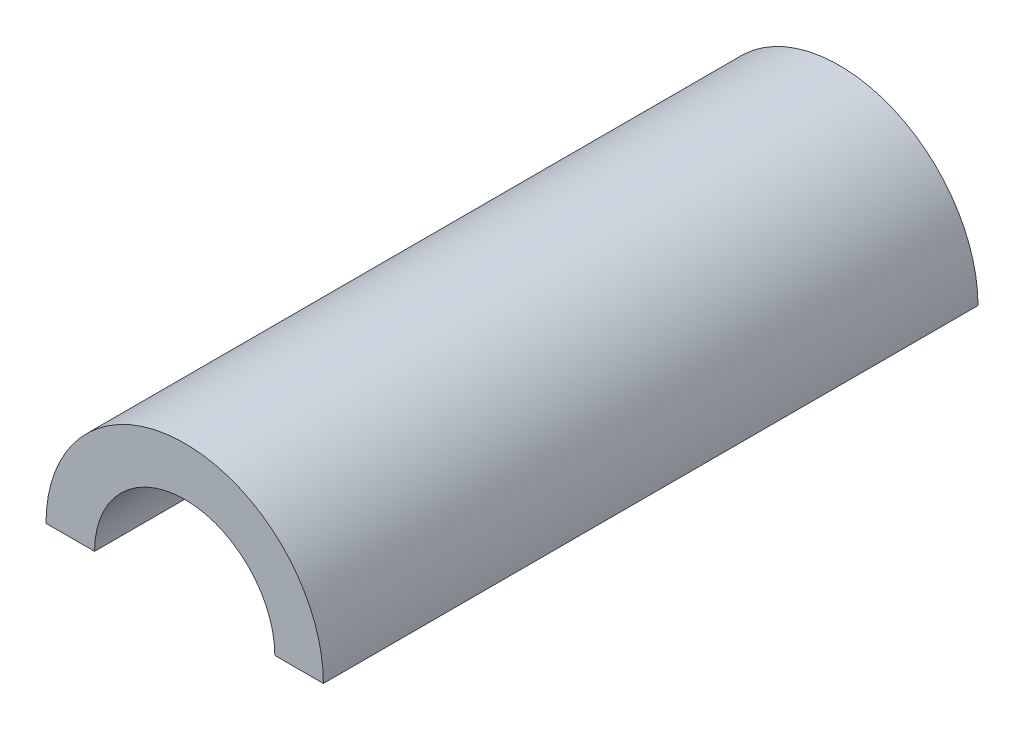
ISO-10303-21;
HEADER;
FILE_DESCRIPTION(('STEP AP214'),'2;1');
FILE_NAME('part.step','',(''),(''),'','','');
FILE_SCHEMA(('AUTOMOTIVE_DESIGN { 1 0 10303 214 1 1 1 1 }'));
ENDSEC;
DATA;
#1=APPLICATION_CONTEXT('core data for automotive mechanical design processes');
#2=APPLICATION_PROTOCOL_DEFINITION('international standard','automotive_design',2000,#1);
#3=PRODUCT_CONTEXT('',#1,'mechanical');
#4=PRODUCT('Part','Part','',(#3));
#5=PRODUCT_RELATED_PRODUCT_CATEGORY('part','',(#4));
#6=PRODUCT_DEFINITION_FORMATION('','',#4);
#7=PRODUCT_DEFINITION_CONTEXT('part definition',#1,'design');
#8=PRODUCT_DEFINITION('design','',#6,#7);
#9=PRODUCT_DEFINITION_SHAPE('','',#8);
#10=(LENGTH_UNIT() NAMED_UNIT(*) SI_UNIT(.MILLI.,.METRE.));
#11=(NAMED_UNIT(*) PLANE_ANGLE_UNIT() SI_UNIT($,.RADIAN.));
#12=(NAMED_UNIT(*) SI_UNIT($,.STERADIAN.) SOLID_ANGLE_UNIT());
#13=UNCERTAINTY_MEASURE_WITH_UNIT(LENGTH_MEASURE(1.E-05),#10,'distance_accuracy_value','');
#14=(GEOMETRIC_REPRESENTATION_CONTEXT(3) GLOBAL_UNCERTAINTY_ASSIGNED_CONTEXT((#13)) GLOBAL_UNIT_ASSIGNED_CONTEXT((#10,
#11,#12)) REPRESENTATION_CONTEXT('',''));
#15=CARTESIAN_POINT('',(0.,0.,0.));
#16=DIRECTION('',(0.,0.,1.));
#17=DIRECTION('',(1.,0.,0.));
#18=AXIS2_PLACEMENT_3D('',#15,#16,#17);
#19=CARTESIAN_POINT('',(0.,0.,47.2));
#20=DIRECTION('',(0.,-1.,0.));
#21=DIRECTION('',(0.,0.,-1.));
#22=AXIS2_PLACEMENT_3D('',#19,#20,#21);
#23=PLANE('',#22);
#24=DIRECTION('',(-1.,0.,0.));
#25=VECTOR('',#24,1.);
#26=CARTESIAN_POINT('',(0.,0.,0.));
#27=LINE('',#26,#25);
#28=CARTESIAN_POINT('',(10.,0.,0.));
#29=VERTEX_POINT('',#28);
#30=CARTESIAN_POINT('',(6.5,0.,0.));
#31=VERTEX_POINT('',#30);
#32=EDGE_CURVE('E120',#29,#31,#27,.T.);
#33=ORIENTED_EDGE('',*,*,#32,.F.);
#34=DIRECTION('',(0.,0.,-1.));
#35=VECTOR('',#34,1.);
#36=CARTESIAN_POINT('',(10.,0.,47.2));
#37=LINE('',#36,#35);
#38=CARTESIAN_POINT('',(10.,0.,47.2));
#39=VERTEX_POINT('',#38);
#40=EDGE_CURVE('E11',#39,#29,#37,.T.);
#41=ORIENTED_EDGE('',*,*,#40,.F.);
#42=DIRECTION('',(-1.,0.,0.));
#43=VECTOR('',#42,1.);
#44=CARTESIAN_POINT('',(0.,0.,47.2));
#45=LINE('',#44,#43);
#46=CARTESIAN_POINT('',(6.5,0.,47.2));
#47=VERTEX_POINT('',#46);
#48=EDGE_CURVE('E95',#39,#47,#45,.T.);
#49=ORIENTED_EDGE('',*,*,#48,.T.);
#50=DIRECTION('',(0.,0.,-1.));
#51=VECTOR('',#50,1.);
#52=CARTESIAN_POINT('',(6.5,0.,47.2));
#53=LINE('',#52,#51);
#54=EDGE_CURVE('E63',#47,#31,#53,.T.);
#55=ORIENTED_EDGE('',*,*,#54,.T.);
#56=EDGE_LOOP('',(#33,#41,#49,#55));
#57=FACE_BOUND('',#56,.T.);
#58=ADVANCED_FACE('F45',(#57),#23,.T.);
#59=CARTESIAN_POINT('',(0.,0.,47.2));
#60=DIRECTION('',(0.,0.,-1.));
#61=DIRECTION('',(-1.,0.,0.));
#62=AXIS2_PLACEMENT_3D('',#59,#60,#61);
#63=CYLINDRICAL_SURFACE('',#62,10.);
#64=CARTESIAN_POINT('',(0.,0.,0.));
#65=DIRECTION('',(0.,0.,1.));
#66=DIRECTION('',(1.,0.,0.));
#67=AXIS2_PLACEMENT_3D('',#64,#65,#66);
#68=CIRCLE('',#67,10.);
#69=CARTESIAN_POINT('',(-10.,0.,0.));
#70=VERTEX_POINT('',#69);
#71=EDGE_CURVE('E101',#29,#70,#68,.T.);
#72=ORIENTED_EDGE('',*,*,#71,.T.);
#73=DIRECTION('',(0.,0.,-1.));
#74=VECTOR('',#73,1.);
#75=CARTESIAN_POINT('',(-10.,0.,47.2));
#76=LINE('',#75,#74);
#77=CARTESIAN_POINT('',(-10.,0.,47.2));
#78=VERTEX_POINT('',#77);
#79=EDGE_CURVE('E55',#78,#70,#76,.T.);
#80=ORIENTED_EDGE('',*,*,#79,.F.);
#81=CARTESIAN_POINT('',(0.,0.,47.2));
#82=DIRECTION('',(0.,0.,1.));
#83=DIRECTION('',(1.,0.,0.));
#84=AXIS2_PLACEMENT_3D('',#81,#82,#83);
#85=CIRCLE('',#84,10.);
#86=EDGE_CURVE('E89',#39,#78,#85,.T.);
#87=ORIENTED_EDGE('',*,*,#86,.F.);
#88=ORIENTED_EDGE('',*,*,#40,.T.);
#89=EDGE_LOOP('',(#72,#80,#87,#88));
#90=FACE_BOUND('',#89,.T.);
#91=ADVANCED_FACE('F47',(#90),#63,.T.);
#92=CARTESIAN_POINT('',(-6.5,0.,0.));
#93=VERTEX_POINT('',#92);
#94=EDGE_CURVE('E115',#93,#70,#27,.T.);
#95=ORIENTED_EDGE('',*,*,#94,.F.);
#96=DIRECTION('',(0.,0.,-1.));
#97=VECTOR('',#96,1.);
#98=CARTESIAN_POINT('',(-6.5,0.,47.2));
#99=LINE('',#98,#97);
#100=CARTESIAN_POINT('',(-6.5,0.,47.2));
#101=VERTEX_POINT('',#100);
#102=EDGE_CURVE('E76',#101,#93,#99,.T.);
#103=ORIENTED_EDGE('',*,*,#102,.F.);
#104=EDGE_CURVE('E94',#101,#78,#45,.T.);
#105=ORIENTED_EDGE('',*,*,#104,.T.);
#106=ORIENTED_EDGE('',*,*,#79,.T.);
#107=EDGE_LOOP('',(#95,#103,#105,#106));
#108=FACE_BOUND('',#107,.T.);
#109=ADVANCED_FACE('F105',(#108),#23,.T.);
#110=CARTESIAN_POINT('',(0.,0.,47.2));
#111=DIRECTION('',(0.,0.,-1.));
#112=DIRECTION('',(-1.,0.,0.));
#113=AXIS2_PLACEMENT_3D('',#110,#111,#112);
#114=CYLINDRICAL_SURFACE('',#113,6.5);
#115=CARTESIAN_POINT('',(0.,0.,0.));
#116=DIRECTION('',(0.,0.,1.));
#117=DIRECTION('',(1.,0.,0.));
#118=AXIS2_PLACEMENT_3D('',#115,#116,#117);
#119=CIRCLE('',#118,6.5);
#120=EDGE_CURVE('E112',#31,#93,#119,.T.);
#121=ORIENTED_EDGE('',*,*,#120,.F.);
#122=ORIENTED_EDGE('',*,*,#54,.F.);
#123=CARTESIAN_POINT('',(0.,0.,47.2));
#124=DIRECTION('',(0.,0.,1.));
#125=DIRECTION('',(1.,0.,0.));
#126=AXIS2_PLACEMENT_3D('',#123,#124,#125);
#127=CIRCLE('',#126,6.5);
#128=EDGE_CURVE('E107',#47,#101,#127,.T.);
#129=ORIENTED_EDGE('',*,*,#128,.T.);
#130=ORIENTED_EDGE('',*,*,#102,.T.);
#131=EDGE_LOOP('',(#121,#122,#129,#130));
#132=FACE_BOUND('',#131,.T.);
#133=ADVANCED_FACE('F129',(#132),#114,.F.);
#134=CARTESIAN_POINT('',(0.,0.,47.2));
#135=DIRECTION('',(0.,0.,1.));
#136=DIRECTION('',(1.,0.,0.));
#137=AXIS2_PLACEMENT_3D('',#134,#135,#136);
#138=PLANE('',#137);
#139=ORIENTED_EDGE('',*,*,#48,.F.);
#140=ORIENTED_EDGE('',*,*,#86,.T.);
#141=ORIENTED_EDGE('',*,*,#104,.F.);
#142=ORIENTED_EDGE('',*,*,#128,.F.);
#143=EDGE_LOOP('',(#139,#140,#141,#142));
#144=FACE_BOUND('',#143,.T.);
#145=ADVANCED_FACE('F91',(#144),#138,.T.);
#146=CARTESIAN_POINT('',(0.,0.,0.));
#147=DIRECTION('',(0.,0.,1.));
#148=DIRECTION('',(1.,0.,0.));
#149=AXIS2_PLACEMENT_3D('',#146,#147,#148);
#150=PLANE('',#149);
#151=ORIENTED_EDGE('',*,*,#32,.T.);
#152=ORIENTED_EDGE('',*,*,#120,.T.);
#153=ORIENTED_EDGE('',*,*,#94,.T.);
#154=ORIENTED_EDGE('',*,*,#71,.F.);
#155=EDGE_LOOP('',(#151,#152,#153,#154));
#156=FACE_BOUND('',#155,.T.);
#157=ADVANCED_FACE('F128',(#156),#150,.F.);
#158=CLOSED_SHELL('',(#58,#91,#109,#133,#145,#157));
#159=MANIFOLD_SOLID_BREP('B2',#158);
#160=ADVANCED_BREP_SHAPE_REPRESENTATION('',(#18,#159),#14);
#161=SHAPE_DEFINITION_REPRESENTATION(#9,#160);
ENDSEC;
END-ISO-10303-21;
